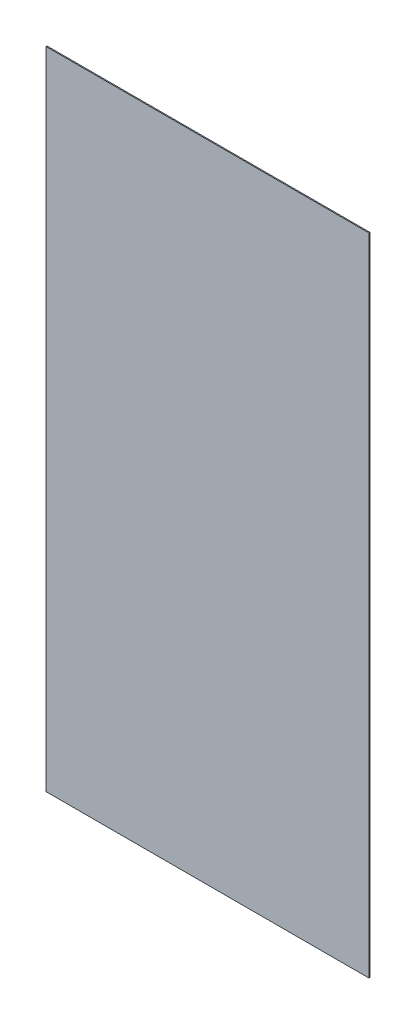
ISO-10303-21;
HEADER;
FILE_DESCRIPTION(('STEP AP214'),'2;1');
FILE_NAME('part.step','',(''),(''),'','','');
FILE_SCHEMA(('AUTOMOTIVE_DESIGN { 1 0 10303 214 1 1 1 1 }'));
ENDSEC;
DATA;
#1=APPLICATION_CONTEXT('core data for automotive mechanical design processes');
#2=APPLICATION_PROTOCOL_DEFINITION('international standard','automotive_design',2000,#1);
#3=PRODUCT_CONTEXT('',#1,'mechanical');
#4=PRODUCT('Part','Part','',(#3));
#5=PRODUCT_RELATED_PRODUCT_CATEGORY('part','',(#4));
#6=PRODUCT_DEFINITION_FORMATION('','',#4);
#7=PRODUCT_DEFINITION_CONTEXT('part definition',#1,'design');
#8=PRODUCT_DEFINITION('design','',#6,#7);
#9=PRODUCT_DEFINITION_SHAPE('','',#8);
#10=(LENGTH_UNIT() NAMED_UNIT(*) SI_UNIT(.MILLI.,.METRE.));
#11=(NAMED_UNIT(*) PLANE_ANGLE_UNIT() SI_UNIT($,.RADIAN.));
#12=(NAMED_UNIT(*) SI_UNIT($,.STERADIAN.) SOLID_ANGLE_UNIT());
#13=UNCERTAINTY_MEASURE_WITH_UNIT(LENGTH_MEASURE(1.E-05),#10,'distance_accuracy_value','');
#14=(GEOMETRIC_REPRESENTATION_CONTEXT(3) GLOBAL_UNCERTAINTY_ASSIGNED_CONTEXT((#13)) GLOBAL_UNIT_ASSIGNED_CONTEXT((#10,
#11,#12)) REPRESENTATION_CONTEXT('',''));
#15=CARTESIAN_POINT('',(0.,0.,0.));
#16=DIRECTION('',(0.,0.,1.));
#17=DIRECTION('',(1.,0.,0.));
#18=AXIS2_PLACEMENT_3D('',#15,#16,#17);
#19=CARTESIAN_POINT('',(0.,0.,0.75));
#20=DIRECTION('',(1.,0.,0.));
#21=DIRECTION('',(0.,0.,-1.));
#22=AXIS2_PLACEMENT_3D('',#19,#20,#21);
#23=PLANE('',#22);
#24=DIRECTION('',(0.,-1.,0.));
#25=VECTOR('',#24,1.);
#26=CARTESIAN_POINT('',(0.,0.,0.));
#27=LINE('',#26,#25);
#28=CARTESIAN_POINT('',(0.,484.8,0.));
#29=VERTEX_POINT('',#28);
#30=CARTESIAN_POINT('',(0.,0.,0.));
#31=VERTEX_POINT('',#30);
#32=EDGE_CURVE('E97',#29,#31,#27,.T.);
#33=ORIENTED_EDGE('',*,*,#32,.T.);
#34=DIRECTION('',(0.,0.,-1.));
#35=VECTOR('',#34,1.);
#36=CARTESIAN_POINT('',(0.,0.,0.75));
#37=LINE('',#36,#35);
#38=CARTESIAN_POINT('',(0.,0.,0.75));
#39=VERTEX_POINT('',#38);
#40=EDGE_CURVE('E11',#39,#31,#37,.T.);
#41=ORIENTED_EDGE('',*,*,#40,.F.);
#42=DIRECTION('',(0.,-1.,0.));
#43=VECTOR('',#42,1.);
#44=CARTESIAN_POINT('',(0.,0.,0.75));
#45=LINE('',#44,#43);
#46=CARTESIAN_POINT('',(0.,484.8,0.75));
#47=VERTEX_POINT('',#46);
#48=EDGE_CURVE('E85',#47,#39,#45,.T.);
#49=ORIENTED_EDGE('',*,*,#48,.F.);
#50=DIRECTION('',(0.,0.,-1.));
#51=VECTOR('',#50,1.);
#52=CARTESIAN_POINT('',(0.,484.8,0.75));
#53=LINE('',#52,#51);
#54=EDGE_CURVE('E93',#47,#29,#53,.T.);
#55=ORIENTED_EDGE('',*,*,#54,.T.);
#56=EDGE_LOOP('',(#33,#41,#49,#55));
#57=FACE_BOUND('',#56,.T.);
#58=ADVANCED_FACE('F34',(#57),#23,.F.);
#59=CARTESIAN_POINT('',(0.,0.,0.75));
#60=DIRECTION('',(0.,1.,0.));
#61=DIRECTION('',(0.,0.,1.));
#62=AXIS2_PLACEMENT_3D('',#59,#60,#61);
#63=PLANE('',#62);
#64=DIRECTION('',(1.,0.,0.));
#65=VECTOR('',#64,1.);
#66=CARTESIAN_POINT('',(0.,0.,0.));
#67=LINE('',#66,#65);
#68=CARTESIAN_POINT('',(242.4,0.,0.));
#69=VERTEX_POINT('',#68);
#70=EDGE_CURVE('E89',#31,#69,#67,.T.);
#71=ORIENTED_EDGE('',*,*,#70,.T.);
#72=DIRECTION('',(0.,0.,-1.));
#73=VECTOR('',#72,1.);
#74=CARTESIAN_POINT('',(242.4,0.,0.75));
#75=LINE('',#74,#73);
#76=CARTESIAN_POINT('',(242.4,0.,0.75));
#77=VERTEX_POINT('',#76);
#78=EDGE_CURVE('E42',#77,#69,#75,.T.);
#79=ORIENTED_EDGE('',*,*,#78,.F.);
#80=DIRECTION('',(1.,0.,0.));
#81=VECTOR('',#80,1.);
#82=CARTESIAN_POINT('',(0.,0.,0.75));
#83=LINE('',#82,#81);
#84=EDGE_CURVE('E80',#39,#77,#83,.T.);
#85=ORIENTED_EDGE('',*,*,#84,.F.);
#86=ORIENTED_EDGE('',*,*,#40,.T.);
#87=EDGE_LOOP('',(#71,#79,#85,#86));
#88=FACE_BOUND('',#87,.T.);
#89=ADVANCED_FACE('F88',(#88),#63,.F.);
#90=CARTESIAN_POINT('',(242.4,0.,0.75));
#91=DIRECTION('',(-1.,0.,0.));
#92=DIRECTION('',(0.,0.,1.));
#93=AXIS2_PLACEMENT_3D('',#90,#91,#92);
#94=PLANE('',#93);
#95=DIRECTION('',(0.,1.,0.));
#96=VECTOR('',#95,1.);
#97=CARTESIAN_POINT('',(242.4,0.,0.));
#98=LINE('',#97,#96);
#99=CARTESIAN_POINT('',(242.4,484.8,0.));
#100=VERTEX_POINT('',#99);
#101=EDGE_CURVE('E67',#69,#100,#98,.T.);
#102=ORIENTED_EDGE('',*,*,#101,.T.);
#103=DIRECTION('',(0.,0.,-1.));
#104=VECTOR('',#103,1.);
#105=CARTESIAN_POINT('',(242.4,484.8,0.75));
#106=LINE('',#105,#104);
#107=CARTESIAN_POINT('',(242.4,484.8,0.75));
#108=VERTEX_POINT('',#107);
#109=EDGE_CURVE('E90',#108,#100,#106,.T.);
#110=ORIENTED_EDGE('',*,*,#109,.F.);
#111=DIRECTION('',(0.,1.,0.));
#112=VECTOR('',#111,1.);
#113=CARTESIAN_POINT('',(242.4,0.,0.75));
#114=LINE('',#113,#112);
#115=EDGE_CURVE('E83',#77,#108,#114,.T.);
#116=ORIENTED_EDGE('',*,*,#115,.F.);
#117=ORIENTED_EDGE('',*,*,#78,.T.);
#118=EDGE_LOOP('',(#102,#110,#116,#117));
#119=FACE_BOUND('',#118,.T.);
#120=ADVANCED_FACE('F91',(#119),#94,.F.);
#121=CARTESIAN_POINT('',(0.,484.8,0.75));
#122=DIRECTION('',(0.,-1.,0.));
#123=DIRECTION('',(0.,0.,-1.));
#124=AXIS2_PLACEMENT_3D('',#121,#122,#123);
#125=PLANE('',#124);
#126=DIRECTION('',(-1.,0.,0.));
#127=VECTOR('',#126,1.);
#128=CARTESIAN_POINT('',(0.,484.8,0.));
#129=LINE('',#128,#127);
#130=EDGE_CURVE('E73',#100,#29,#129,.T.);
#131=ORIENTED_EDGE('',*,*,#130,.T.);
#132=ORIENTED_EDGE('',*,*,#54,.F.);
#133=DIRECTION('',(-1.,0.,0.));
#134=VECTOR('',#133,1.);
#135=CARTESIAN_POINT('',(0.,484.8,0.75));
#136=LINE('',#135,#134);
#137=EDGE_CURVE('E50',#108,#47,#136,.T.);
#138=ORIENTED_EDGE('',*,*,#137,.F.);
#139=ORIENTED_EDGE('',*,*,#109,.T.);
#140=EDGE_LOOP('',(#131,#132,#138,#139));
#141=FACE_BOUND('',#140,.T.);
#142=ADVANCED_FACE('F104',(#141),#125,.F.);
#143=CARTESIAN_POINT('',(0.,0.,0.75));
#144=DIRECTION('',(0.,0.,-1.));
#145=DIRECTION('',(-1.,0.,0.));
#146=AXIS2_PLACEMENT_3D('',#143,#144,#145);
#147=PLANE('',#146);
#148=ORIENTED_EDGE('',*,*,#48,.T.);
#149=ORIENTED_EDGE('',*,*,#84,.T.);
#150=ORIENTED_EDGE('',*,*,#115,.T.);
#151=ORIENTED_EDGE('',*,*,#137,.T.);
#152=EDGE_LOOP('',(#148,#149,#150,#151));
#153=FACE_BOUND('',#152,.T.);
#154=ADVANCED_FACE('F81',(#153),#147,.F.);
#155=CARTESIAN_POINT('',(0.,0.,0.));
#156=DIRECTION('',(0.,0.,-1.));
#157=DIRECTION('',(-1.,0.,0.));
#158=AXIS2_PLACEMENT_3D('',#155,#156,#157);
#159=PLANE('',#158);
#160=ORIENTED_EDGE('',*,*,#32,.F.);
#161=ORIENTED_EDGE('',*,*,#130,.F.);
#162=ORIENTED_EDGE('',*,*,#101,.F.);
#163=ORIENTED_EDGE('',*,*,#70,.F.);
#164=EDGE_LOOP('',(#160,#161,#162,#163));
#165=FACE_BOUND('',#164,.T.);
#166=ADVANCED_FACE('F107',(#165),#159,.T.);
#167=CLOSED_SHELL('',(#58,#89,#120,#142,#154,#166));
#168=MANIFOLD_SOLID_BREP('B2',#167);
#169=ADVANCED_BREP_SHAPE_REPRESENTATION('',(#18,#168),#14);
#170=SHAPE_DEFINITION_REPRESENTATION(#9,#169);
ENDSEC;
END-ISO-10303-21;
